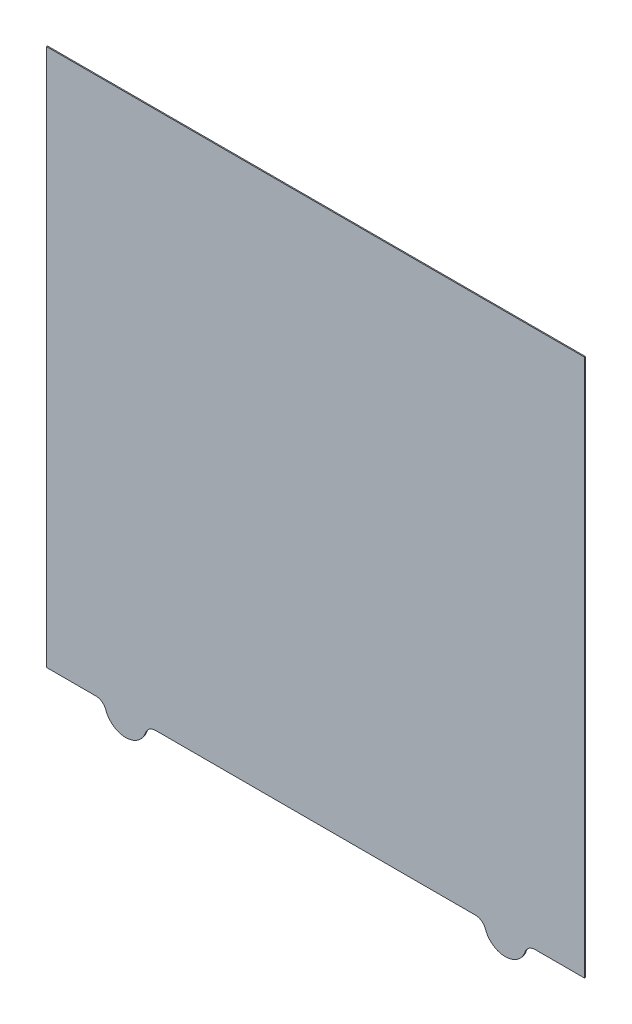
ISO-10303-21;
HEADER;
FILE_DESCRIPTION(('STEP AP214'),'2;1');
FILE_NAME('part.step','',(''),(''),'','','');
FILE_SCHEMA(('AUTOMOTIVE_DESIGN { 1 0 10303 214 1 1 1 1 }'));
ENDSEC;
DATA;
#1=APPLICATION_CONTEXT('core data for automotive mechanical design processes');
#2=APPLICATION_PROTOCOL_DEFINITION('international standard','automotive_design',2000,#1);
#3=PRODUCT_CONTEXT('',#1,'mechanical');
#4=PRODUCT('Part','Part','',(#3));
#5=PRODUCT_RELATED_PRODUCT_CATEGORY('part','',(#4));
#6=PRODUCT_DEFINITION_FORMATION('','',#4);
#7=PRODUCT_DEFINITION_CONTEXT('part definition',#1,'design');
#8=PRODUCT_DEFINITION('design','',#6,#7);
#9=PRODUCT_DEFINITION_SHAPE('','',#8);
#10=(LENGTH_UNIT() NAMED_UNIT(*) SI_UNIT(.MILLI.,.METRE.));
#11=(NAMED_UNIT(*) PLANE_ANGLE_UNIT() SI_UNIT($,.RADIAN.));
#12=(NAMED_UNIT(*) SI_UNIT($,.STERADIAN.) SOLID_ANGLE_UNIT());
#13=UNCERTAINTY_MEASURE_WITH_UNIT(LENGTH_MEASURE(1.E-05),#10,'distance_accuracy_value','');
#14=(GEOMETRIC_REPRESENTATION_CONTEXT(3) GLOBAL_UNCERTAINTY_ASSIGNED_CONTEXT((#13)) GLOBAL_UNIT_ASSIGNED_CONTEXT((#10,
#11,#12)) REPRESENTATION_CONTEXT('',''));
#15=CARTESIAN_POINT('',(0.,0.,0.));
#16=DIRECTION('',(0.,0.,1.));
#17=DIRECTION('',(1.,0.,0.));
#18=AXIS2_PLACEMENT_3D('',#15,#16,#17);
#19=CARTESIAN_POINT('',(255.,-255.,1.));
#20=DIRECTION('',(-1.,0.,0.));
#21=DIRECTION('',(0.,0.,1.));
#22=AXIS2_PLACEMENT_3D('',#19,#20,#21);
#23=PLANE('',#22);
#24=DIRECTION('',(0.,1.,0.));
#25=VECTOR('',#24,1.);
#26=CARTESIAN_POINT('',(255.,-255.,0.));
#27=LINE('',#26,#25);
#28=CARTESIAN_POINT('',(255.,-255.,0.));
#29=VERTEX_POINT('',#28);
#30=CARTESIAN_POINT('',(255.,255.,0.));
#31=VERTEX_POINT('',#30);
#32=EDGE_CURVE('E182',#29,#31,#27,.T.);
#33=ORIENTED_EDGE('',*,*,#32,.T.);
#34=DIRECTION('',(0.,0.,-1.));
#35=VECTOR('',#34,1.);
#36=CARTESIAN_POINT('',(255.,255.,1.));
#37=LINE('',#36,#35);
#38=CARTESIAN_POINT('',(255.,255.,1.));
#39=VERTEX_POINT('',#38);
#40=EDGE_CURVE('E11',#39,#31,#37,.T.);
#41=ORIENTED_EDGE('',*,*,#40,.F.);
#42=DIRECTION('',(0.,1.,0.));
#43=VECTOR('',#42,1.);
#44=CARTESIAN_POINT('',(255.,-255.,1.));
#45=LINE('',#44,#43);
#46=CARTESIAN_POINT('',(255.,-255.,1.));
#47=VERTEX_POINT('',#46);
#48=EDGE_CURVE('E215',#47,#39,#45,.T.);
#49=ORIENTED_EDGE('',*,*,#48,.F.);
#50=DIRECTION('',(0.,0.,-1.));
#51=VECTOR('',#50,1.);
#52=CARTESIAN_POINT('',(255.,-255.,1.));
#53=LINE('',#52,#51);
#54=EDGE_CURVE('E178',#47,#29,#53,.T.);
#55=ORIENTED_EDGE('',*,*,#54,.T.);
#56=EDGE_LOOP('',(#33,#41,#49,#55));
#57=FACE_BOUND('',#56,.T.);
#58=ADVANCED_FACE('F39',(#57),#23,.F.);
#59=CARTESIAN_POINT('',(-255.,255.,1.));
#60=DIRECTION('',(0.,-1.,0.));
#61=DIRECTION('',(0.,0.,-1.));
#62=AXIS2_PLACEMENT_3D('',#59,#60,#61);
#63=PLANE('',#62);
#64=DIRECTION('',(-1.,0.,0.));
#65=VECTOR('',#64,1.);
#66=CARTESIAN_POINT('',(-255.,255.,0.));
#67=LINE('',#66,#65);
#68=CARTESIAN_POINT('',(-255.,255.,0.));
#69=VERTEX_POINT('',#68);
#70=EDGE_CURVE('E186',#31,#69,#67,.T.);
#71=ORIENTED_EDGE('',*,*,#70,.T.);
#72=DIRECTION('',(0.,0.,-1.));
#73=VECTOR('',#72,1.);
#74=CARTESIAN_POINT('',(-255.,255.,1.));
#75=LINE('',#74,#73);
#76=CARTESIAN_POINT('',(-255.,255.,1.));
#77=VERTEX_POINT('',#76);
#78=EDGE_CURVE('E48',#77,#69,#75,.T.);
#79=ORIENTED_EDGE('',*,*,#78,.F.);
#80=DIRECTION('',(-1.,0.,0.));
#81=VECTOR('',#80,1.);
#82=CARTESIAN_POINT('',(-255.,255.,1.));
#83=LINE('',#82,#81);
#84=EDGE_CURVE('E124',#39,#77,#83,.T.);
#85=ORIENTED_EDGE('',*,*,#84,.F.);
#86=ORIENTED_EDGE('',*,*,#40,.T.);
#87=EDGE_LOOP('',(#71,#79,#85,#86));
#88=FACE_BOUND('',#87,.T.);
#89=ADVANCED_FACE('F292',(#88),#63,.F.);
#90=CARTESIAN_POINT('',(-255.,-255.,1.));
#91=DIRECTION('',(1.,0.,0.));
#92=DIRECTION('',(0.,0.,-1.));
#93=AXIS2_PLACEMENT_3D('',#90,#91,#92);
#94=PLANE('',#93);
#95=DIRECTION('',(0.,-1.,0.));
#96=VECTOR('',#95,1.);
#97=CARTESIAN_POINT('',(-255.,-255.,0.));
#98=LINE('',#97,#96);
#99=CARTESIAN_POINT('',(-255.,-255.,0.));
#100=VERTEX_POINT('',#99);
#101=EDGE_CURVE('E189',#69,#100,#98,.T.);
#102=ORIENTED_EDGE('',*,*,#101,.T.);
#103=DIRECTION('',(0.,0.,-1.));
#104=VECTOR('',#103,1.);
#105=CARTESIAN_POINT('',(-255.,-255.,1.));
#106=LINE('',#105,#104);
#107=CARTESIAN_POINT('',(-255.,-255.,1.));
#108=VERTEX_POINT('',#107);
#109=EDGE_CURVE('E241',#108,#100,#106,.T.);
#110=ORIENTED_EDGE('',*,*,#109,.F.);
#111=DIRECTION('',(0.,-1.,0.));
#112=VECTOR('',#111,1.);
#113=CARTESIAN_POINT('',(-255.,-255.,1.));
#114=LINE('',#113,#112);
#115=EDGE_CURVE('E251',#77,#108,#114,.T.);
#116=ORIENTED_EDGE('',*,*,#115,.F.);
#117=ORIENTED_EDGE('',*,*,#78,.T.);
#118=EDGE_LOOP('',(#102,#110,#116,#117));
#119=FACE_BOUND('',#118,.T.);
#120=ADVANCED_FACE('F249',(#119),#94,.F.);
#121=CARTESIAN_POINT('',(-255.,-255.,1.));
#122=DIRECTION('',(0.,1.,0.));
#123=DIRECTION('',(0.,0.,1.));
#124=AXIS2_PLACEMENT_3D('',#121,#122,#123);
#125=PLANE('',#124);
#126=DIRECTION('',(1.,0.,0.));
#127=VECTOR('',#126,1.);
#128=CARTESIAN_POINT('',(-255.,-255.,0.));
#129=LINE('',#128,#127);
#130=CARTESIAN_POINT('',(-208.284271247462,-255.,0.));
#131=VERTEX_POINT('',#130);
#132=EDGE_CURVE('E192',#100,#131,#129,.T.);
#133=ORIENTED_EDGE('',*,*,#132,.T.);
#134=DIRECTION('',(0.,0.,-1.));
#135=VECTOR('',#134,1.);
#136=CARTESIAN_POINT('',(-208.284271247462,-255.,1.));
#137=LINE('',#136,#135);
#138=CARTESIAN_POINT('',(-208.284271247462,-255.,1.));
#139=VERTEX_POINT('',#138);
#140=EDGE_CURVE('E237',#139,#131,#137,.T.);
#141=ORIENTED_EDGE('',*,*,#140,.F.);
#142=DIRECTION('',(1.,0.,0.));
#143=VECTOR('',#142,1.);
#144=CARTESIAN_POINT('',(-255.,-255.,1.));
#145=LINE('',#144,#143);
#146=EDGE_CURVE('E270',#108,#139,#145,.T.);
#147=ORIENTED_EDGE('',*,*,#146,.F.);
#148=ORIENTED_EDGE('',*,*,#109,.T.);
#149=EDGE_LOOP('',(#133,#141,#147,#148));
#150=FACE_BOUND('',#149,.T.);
#151=ADVANCED_FACE('F260',(#150),#125,.F.);
#152=CARTESIAN_POINT('',(-208.284271247462,-265.,1.));
#153=DIRECTION('',(0.,0.,-1.));
#154=DIRECTION('',(-1.,0.,0.));
#155=AXIS2_PLACEMENT_3D('',#152,#153,#154);
#156=CYLINDRICAL_SURFACE('',#155,10.);
#157=CARTESIAN_POINT('',(-208.284271247462,-265.,0.));
#158=DIRECTION('',(0.,0.,-1.));
#159=DIRECTION('',(1.,0.,0.));
#160=AXIS2_PLACEMENT_3D('',#157,#158,#159);
#161=CIRCLE('',#160,10.);
#162=CARTESIAN_POINT('',(-198.856180831641,-261.666666666667,0.));
#163=VERTEX_POINT('',#162);
#164=EDGE_CURVE('E195',#131,#163,#161,.T.);
#165=ORIENTED_EDGE('',*,*,#164,.T.);
#166=DIRECTION('',(0.,0.,-1.));
#167=VECTOR('',#166,1.);
#168=CARTESIAN_POINT('',(-198.856180831641,-261.666666666667,1.));
#169=LINE('',#168,#167);
#170=CARTESIAN_POINT('',(-198.856180831641,-261.666666666667,1.));
#171=VERTEX_POINT('',#170);
#172=EDGE_CURVE('E233',#171,#163,#169,.T.);
#173=ORIENTED_EDGE('',*,*,#172,.F.);
#174=CARTESIAN_POINT('',(-208.284271247462,-265.,1.));
#175=DIRECTION('',(0.,0.,-1.));
#176=DIRECTION('',(1.,0.,0.));
#177=AXIS2_PLACEMENT_3D('',#174,#175,#176);
#178=CIRCLE('',#177,10.);
#179=EDGE_CURVE('E266',#139,#171,#178,.T.);
#180=ORIENTED_EDGE('',*,*,#179,.F.);
#181=ORIENTED_EDGE('',*,*,#140,.T.);
#182=EDGE_LOOP('',(#165,#173,#180,#181));
#183=FACE_BOUND('',#182,.T.);
#184=ADVANCED_FACE('F264',(#183),#156,.F.);
#185=CARTESIAN_POINT('',(-180.,-255.,1.));
#186=DIRECTION('',(0.,0.,-1.));
#187=DIRECTION('',(-1.,0.,0.));
#188=AXIS2_PLACEMENT_3D('',#185,#186,#187);
#189=CYLINDRICAL_SURFACE('',#188,20.);
#190=CARTESIAN_POINT('',(-180.,-255.,0.));
#191=DIRECTION('',(0.,0.,1.));
#192=DIRECTION('',(1.,0.,0.));
#193=AXIS2_PLACEMENT_3D('',#190,#191,#192);
#194=CIRCLE('',#193,20.);
#195=CARTESIAN_POINT('',(-161.143819168359,-261.666666666667,0.));
#196=VERTEX_POINT('',#195);
#197=EDGE_CURVE('E198',#163,#196,#194,.T.);
#198=ORIENTED_EDGE('',*,*,#197,.T.);
#199=DIRECTION('',(0.,0.,-1.));
#200=VECTOR('',#199,1.);
#201=CARTESIAN_POINT('',(-161.143819168359,-261.666666666667,1.));
#202=LINE('',#201,#200);
#203=CARTESIAN_POINT('',(-161.143819168359,-261.666666666667,1.));
#204=VERTEX_POINT('',#203);
#205=EDGE_CURVE('E229',#204,#196,#202,.T.);
#206=ORIENTED_EDGE('',*,*,#205,.F.);
#207=CARTESIAN_POINT('',(-180.,-255.,1.));
#208=DIRECTION('',(0.,0.,1.));
#209=DIRECTION('',(1.,0.,0.));
#210=AXIS2_PLACEMENT_3D('',#207,#208,#209);
#211=CIRCLE('',#210,20.);
#212=EDGE_CURVE('E269',#171,#204,#211,.T.);
#213=ORIENTED_EDGE('',*,*,#212,.F.);
#214=ORIENTED_EDGE('',*,*,#172,.T.);
#215=EDGE_LOOP('',(#198,#206,#213,#214));
#216=FACE_BOUND('',#215,.T.);
#217=ADVANCED_FACE('F304',(#216),#189,.T.);
#218=CARTESIAN_POINT('',(-151.715728752538,-265.,1.));
#219=DIRECTION('',(0.,0.,-1.));
#220=DIRECTION('',(-1.,0.,0.));
#221=AXIS2_PLACEMENT_3D('',#218,#219,#220);
#222=CYLINDRICAL_SURFACE('',#221,10.);
#223=CARTESIAN_POINT('',(-151.715728752538,-265.,0.));
#224=DIRECTION('',(0.,0.,-1.));
#225=DIRECTION('',(-1.,0.,0.));
#226=AXIS2_PLACEMENT_3D('',#223,#224,#225);
#227=CIRCLE('',#226,10.);
#228=CARTESIAN_POINT('',(-151.715728752538,-255.,0.));
#229=VERTEX_POINT('',#228);
#230=EDGE_CURVE('E201',#196,#229,#227,.T.);
#231=ORIENTED_EDGE('',*,*,#230,.T.);
#232=DIRECTION('',(0.,0.,-1.));
#233=VECTOR('',#232,1.);
#234=CARTESIAN_POINT('',(-151.715728752538,-255.,1.));
#235=LINE('',#234,#233);
#236=CARTESIAN_POINT('',(-151.715728752538,-255.,1.));
#237=VERTEX_POINT('',#236);
#238=EDGE_CURVE('E225',#237,#229,#235,.T.);
#239=ORIENTED_EDGE('',*,*,#238,.F.);
#240=CARTESIAN_POINT('',(-151.715728752538,-265.,1.));
#241=DIRECTION('',(0.,0.,-1.));
#242=DIRECTION('',(-1.,0.,0.));
#243=AXIS2_PLACEMENT_3D('',#240,#241,#242);
#244=CIRCLE('',#243,10.);
#245=EDGE_CURVE('E273',#204,#237,#244,.T.);
#246=ORIENTED_EDGE('',*,*,#245,.F.);
#247=ORIENTED_EDGE('',*,*,#205,.T.);
#248=EDGE_LOOP('',(#231,#239,#246,#247));
#249=FACE_BOUND('',#248,.T.);
#250=ADVANCED_FACE('F307',(#249),#222,.F.);
#251=CARTESIAN_POINT('',(-151.715728752538,-255.,1.));
#252=DIRECTION('',(0.,1.,0.));
#253=DIRECTION('',(0.,0.,1.));
#254=AXIS2_PLACEMENT_3D('',#251,#252,#253);
#255=PLANE('',#254);
#256=DIRECTION('',(1.,0.,0.));
#257=VECTOR('',#256,1.);
#258=CARTESIAN_POINT('',(-151.715728752538,-255.,0.));
#259=LINE('',#258,#257);
#260=CARTESIAN_POINT('',(151.715728752538,-255.,0.));
#261=VERTEX_POINT('',#260);
#262=EDGE_CURVE('E204',#229,#261,#259,.T.);
#263=ORIENTED_EDGE('',*,*,#262,.T.);
#264=DIRECTION('',(0.,0.,-1.));
#265=VECTOR('',#264,1.);
#266=CARTESIAN_POINT('',(151.715728752538,-255.,1.));
#267=LINE('',#266,#265);
#268=CARTESIAN_POINT('',(151.715728752538,-255.,1.));
#269=VERTEX_POINT('',#268);
#270=EDGE_CURVE('E221',#269,#261,#267,.T.);
#271=ORIENTED_EDGE('',*,*,#270,.F.);
#272=DIRECTION('',(1.,0.,0.));
#273=VECTOR('',#272,1.);
#274=CARTESIAN_POINT('',(-151.715728752538,-255.,1.));
#275=LINE('',#274,#273);
#276=EDGE_CURVE('E281',#237,#269,#275,.T.);
#277=ORIENTED_EDGE('',*,*,#276,.F.);
#278=ORIENTED_EDGE('',*,*,#238,.T.);
#279=EDGE_LOOP('',(#263,#271,#277,#278));
#280=FACE_BOUND('',#279,.T.);
#281=ADVANCED_FACE('F311',(#280),#255,.F.);
#282=CARTESIAN_POINT('',(151.715728752538,-265.,1.));
#283=DIRECTION('',(0.,0.,-1.));
#284=DIRECTION('',(-1.,0.,0.));
#285=AXIS2_PLACEMENT_3D('',#282,#283,#284);
#286=CYLINDRICAL_SURFACE('',#285,10.);
#287=CARTESIAN_POINT('',(151.715728752538,-265.,0.));
#288=DIRECTION('',(0.,0.,-1.));
#289=DIRECTION('',(1.,0.,0.));
#290=AXIS2_PLACEMENT_3D('',#287,#288,#289);
#291=CIRCLE('',#290,10.);
#292=CARTESIAN_POINT('',(161.143819168359,-261.666666666667,0.));
#293=VERTEX_POINT('',#292);
#294=EDGE_CURVE('E207',#261,#293,#291,.T.);
#295=ORIENTED_EDGE('',*,*,#294,.T.);
#296=DIRECTION('',(0.,0.,-1.));
#297=VECTOR('',#296,1.);
#298=CARTESIAN_POINT('',(161.143819168359,-261.666666666667,1.));
#299=LINE('',#298,#297);
#300=CARTESIAN_POINT('',(161.143819168359,-261.666666666667,1.));
#301=VERTEX_POINT('',#300);
#302=EDGE_CURVE('E172',#301,#293,#299,.T.);
#303=ORIENTED_EDGE('',*,*,#302,.F.);
#304=CARTESIAN_POINT('',(151.715728752538,-265.,1.));
#305=DIRECTION('',(0.,0.,-1.));
#306=DIRECTION('',(1.,0.,0.));
#307=AXIS2_PLACEMENT_3D('',#304,#305,#306);
#308=CIRCLE('',#307,10.);
#309=EDGE_CURVE('E162',#269,#301,#308,.T.);
#310=ORIENTED_EDGE('',*,*,#309,.F.);
#311=ORIENTED_EDGE('',*,*,#270,.T.);
#312=EDGE_LOOP('',(#295,#303,#310,#311));
#313=FACE_BOUND('',#312,.T.);
#314=ADVANCED_FACE('F315',(#313),#286,.F.);
#315=CARTESIAN_POINT('',(180.,-255.,1.));
#316=DIRECTION('',(0.,0.,-1.));
#317=DIRECTION('',(-1.,0.,0.));
#318=AXIS2_PLACEMENT_3D('',#315,#316,#317);
#319=CYLINDRICAL_SURFACE('',#318,20.);
#320=CARTESIAN_POINT('',(180.,-255.,0.));
#321=DIRECTION('',(0.,0.,1.));
#322=DIRECTION('',(1.,0.,0.));
#323=AXIS2_PLACEMENT_3D('',#320,#321,#322);
#324=CIRCLE('',#323,20.);
#325=CARTESIAN_POINT('',(198.856180831641,-261.666666666667,0.));
#326=VERTEX_POINT('',#325);
#327=EDGE_CURVE('E171',#293,#326,#324,.T.);
#328=ORIENTED_EDGE('',*,*,#327,.T.);
#329=DIRECTION('',(0.,0.,-1.));
#330=VECTOR('',#329,1.);
#331=CARTESIAN_POINT('',(198.856180831641,-261.666666666667,1.));
#332=LINE('',#331,#330);
#333=CARTESIAN_POINT('',(198.856180831641,-261.666666666667,1.));
#334=VERTEX_POINT('',#333);
#335=EDGE_CURVE('E168',#334,#326,#332,.T.);
#336=ORIENTED_EDGE('',*,*,#335,.F.);
#337=CARTESIAN_POINT('',(180.,-255.,1.));
#338=DIRECTION('',(0.,0.,1.));
#339=DIRECTION('',(1.,0.,0.));
#340=AXIS2_PLACEMENT_3D('',#337,#338,#339);
#341=CIRCLE('',#340,20.);
#342=EDGE_CURVE('E156',#301,#334,#341,.T.);
#343=ORIENTED_EDGE('',*,*,#342,.F.);
#344=ORIENTED_EDGE('',*,*,#302,.T.);
#345=EDGE_LOOP('',(#328,#336,#343,#344));
#346=FACE_BOUND('',#345,.T.);
#347=ADVANCED_FACE('F169',(#346),#319,.T.);
#348=CARTESIAN_POINT('',(208.284271247462,-265.,1.));
#349=DIRECTION('',(0.,0.,-1.));
#350=DIRECTION('',(-1.,0.,0.));
#351=AXIS2_PLACEMENT_3D('',#348,#349,#350);
#352=CYLINDRICAL_SURFACE('',#351,10.);
#353=CARTESIAN_POINT('',(208.284271247462,-265.,0.));
#354=DIRECTION('',(0.,0.,-1.));
#355=DIRECTION('',(-1.,0.,0.));
#356=AXIS2_PLACEMENT_3D('',#353,#354,#355);
#357=CIRCLE('',#356,10.);
#358=CARTESIAN_POINT('',(208.284271247462,-255.,0.));
#359=VERTEX_POINT('',#358);
#360=EDGE_CURVE('E109',#326,#359,#357,.T.);
#361=ORIENTED_EDGE('',*,*,#360,.T.);
#362=DIRECTION('',(0.,0.,-1.));
#363=VECTOR('',#362,1.);
#364=CARTESIAN_POINT('',(208.284271247462,-255.,1.));
#365=LINE('',#364,#363);
#366=CARTESIAN_POINT('',(208.284271247462,-255.,1.));
#367=VERTEX_POINT('',#366);
#368=EDGE_CURVE('E173',#367,#359,#365,.T.);
#369=ORIENTED_EDGE('',*,*,#368,.F.);
#370=CARTESIAN_POINT('',(208.284271247462,-265.,1.));
#371=DIRECTION('',(0.,0.,-1.));
#372=DIRECTION('',(-1.,0.,0.));
#373=AXIS2_PLACEMENT_3D('',#370,#371,#372);
#374=CIRCLE('',#373,10.);
#375=EDGE_CURVE('E160',#334,#367,#374,.T.);
#376=ORIENTED_EDGE('',*,*,#375,.F.);
#377=ORIENTED_EDGE('',*,*,#335,.T.);
#378=EDGE_LOOP('',(#361,#369,#376,#377));
#379=FACE_BOUND('',#378,.T.);
#380=ADVANCED_FACE('F175',(#379),#352,.F.);
#381=CARTESIAN_POINT('',(208.284271247462,-255.,1.));
#382=DIRECTION('',(0.,1.,0.));
#383=DIRECTION('',(0.,0.,1.));
#384=AXIS2_PLACEMENT_3D('',#381,#382,#383);
#385=PLANE('',#384);
#386=DIRECTION('',(1.,0.,0.));
#387=VECTOR('',#386,1.);
#388=CARTESIAN_POINT('',(208.284271247462,-255.,0.));
#389=LINE('',#388,#387);
#390=EDGE_CURVE('E115',#359,#29,#389,.T.);
#391=ORIENTED_EDGE('',*,*,#390,.T.);
#392=ORIENTED_EDGE('',*,*,#54,.F.);
#393=DIRECTION('',(1.,0.,0.));
#394=VECTOR('',#393,1.);
#395=CARTESIAN_POINT('',(208.284271247462,-255.,1.));
#396=LINE('',#395,#394);
#397=EDGE_CURVE('E59',#367,#47,#396,.T.);
#398=ORIENTED_EDGE('',*,*,#397,.F.);
#399=ORIENTED_EDGE('',*,*,#368,.T.);
#400=EDGE_LOOP('',(#391,#392,#398,#399));
#401=FACE_BOUND('',#400,.T.);
#402=ADVANCED_FACE('F324',(#401),#385,.F.);
#403=CARTESIAN_POINT('',(-208.284271247462,-265.,1.));
#404=DIRECTION('',(0.,0.,1.));
#405=DIRECTION('',(1.,0.,0.));
#406=AXIS2_PLACEMENT_3D('',#403,#404,#405);
#407=PLANE('',#406);
#408=ORIENTED_EDGE('',*,*,#48,.T.);
#409=ORIENTED_EDGE('',*,*,#84,.T.);
#410=ORIENTED_EDGE('',*,*,#115,.T.);
#411=ORIENTED_EDGE('',*,*,#146,.T.);
#412=ORIENTED_EDGE('',*,*,#179,.T.);
#413=ORIENTED_EDGE('',*,*,#212,.T.);
#414=ORIENTED_EDGE('',*,*,#245,.T.);
#415=ORIENTED_EDGE('',*,*,#276,.T.);
#416=ORIENTED_EDGE('',*,*,#309,.T.);
#417=ORIENTED_EDGE('',*,*,#342,.T.);
#418=ORIENTED_EDGE('',*,*,#375,.T.);
#419=ORIENTED_EDGE('',*,*,#397,.T.);
#420=EDGE_LOOP('',(#408,#409,#410,#411,#412,#413,#414,#415,#416,#417,#418,#419));
#421=FACE_BOUND('',#420,.T.);
#422=ADVANCED_FACE('F158',(#421),#407,.T.);
#423=CARTESIAN_POINT('',(-208.284271247462,-265.,0.));
#424=DIRECTION('',(0.,0.,1.));
#425=DIRECTION('',(1.,0.,0.));
#426=AXIS2_PLACEMENT_3D('',#423,#424,#425);
#427=PLANE('',#426);
#428=ORIENTED_EDGE('',*,*,#32,.F.);
#429=ORIENTED_EDGE('',*,*,#390,.F.);
#430=ORIENTED_EDGE('',*,*,#360,.F.);
#431=ORIENTED_EDGE('',*,*,#327,.F.);
#432=ORIENTED_EDGE('',*,*,#294,.F.);
#433=ORIENTED_EDGE('',*,*,#262,.F.);
#434=ORIENTED_EDGE('',*,*,#230,.F.);
#435=ORIENTED_EDGE('',*,*,#197,.F.);
#436=ORIENTED_EDGE('',*,*,#164,.F.);
#437=ORIENTED_EDGE('',*,*,#132,.F.);
#438=ORIENTED_EDGE('',*,*,#101,.F.);
#439=ORIENTED_EDGE('',*,*,#70,.F.);
#440=EDGE_LOOP('',(#428,#429,#430,#431,#432,#433,#434,#435,#436,#437,#438,#439));
#441=FACE_BOUND('',#440,.T.);
#442=ADVANCED_FACE('F255',(#441),#427,.F.);
#443=CLOSED_SHELL('',(#58,#89,#120,#151,#184,#217,#250,#281,#314,#347,#380,#402,#422,#442));
#444=MANIFOLD_SOLID_BREP('B2',#443);
#445=ADVANCED_BREP_SHAPE_REPRESENTATION('',(#18,#444),#14);
#446=SHAPE_DEFINITION_REPRESENTATION(#9,#445);
ENDSEC;
END-ISO-10303-21;
